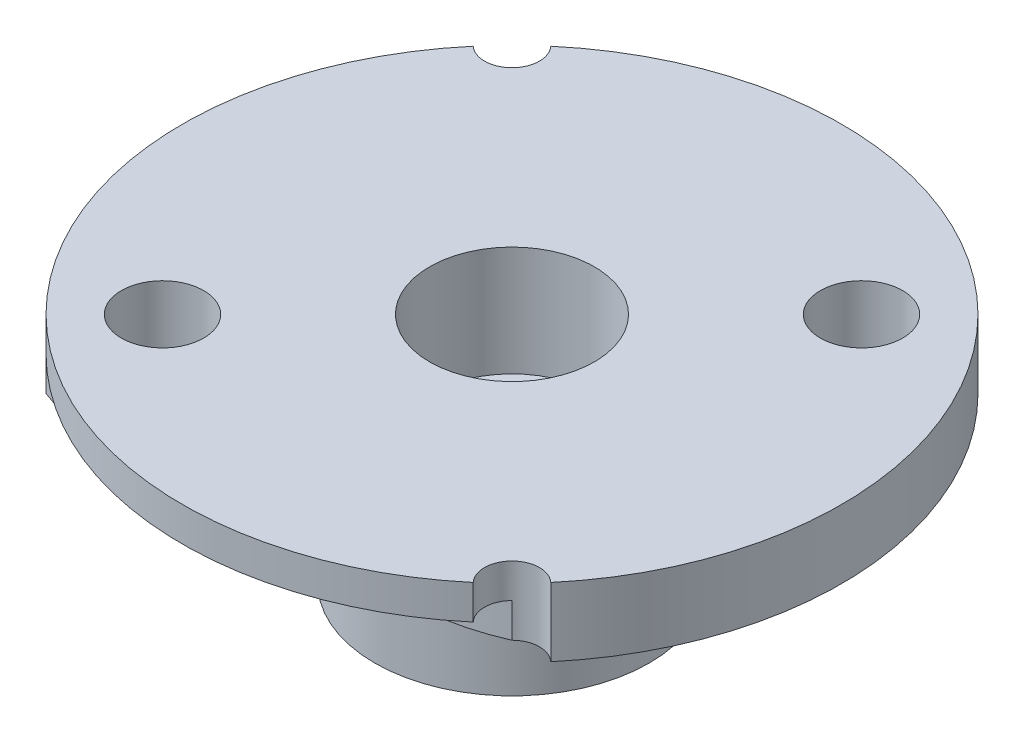
ISO-10303-21;
HEADER;
FILE_DESCRIPTION(('STEP AP214'),'2;1');
FILE_NAME('part.step','',(''),(''),'','','');
FILE_SCHEMA(('AUTOMOTIVE_DESIGN { 1 0 10303 214 1 1 1 1 }'));
ENDSEC;
DATA;
#1=APPLICATION_CONTEXT('core data for automotive mechanical design processes');
#2=APPLICATION_PROTOCOL_DEFINITION('international standard','automotive_design',2000,#1);
#3=PRODUCT_CONTEXT('',#1,'mechanical');
#4=PRODUCT('Part','Part','',(#3));
#5=PRODUCT_RELATED_PRODUCT_CATEGORY('part','',(#4));
#6=PRODUCT_DEFINITION_FORMATION('','',#4);
#7=PRODUCT_DEFINITION_CONTEXT('part definition',#1,'design');
#8=PRODUCT_DEFINITION('design','',#6,#7);
#9=PRODUCT_DEFINITION_SHAPE('','',#8);
#10=(LENGTH_UNIT() NAMED_UNIT(*) SI_UNIT(.MILLI.,.METRE.));
#11=(NAMED_UNIT(*) PLANE_ANGLE_UNIT() SI_UNIT($,.RADIAN.));
#12=(NAMED_UNIT(*) SI_UNIT($,.STERADIAN.) SOLID_ANGLE_UNIT());
#13=UNCERTAINTY_MEASURE_WITH_UNIT(LENGTH_MEASURE(1.E-05),#10,'distance_accuracy_value','');
#14=(GEOMETRIC_REPRESENTATION_CONTEXT(3) GLOBAL_UNCERTAINTY_ASSIGNED_CONTEXT((#13)) GLOBAL_UNIT_ASSIGNED_CONTEXT((#10,
#11,#12)) REPRESENTATION_CONTEXT('',''));
#15=CARTESIAN_POINT('',(0.,0.,0.));
#16=DIRECTION('',(0.,0.,1.));
#17=DIRECTION('',(1.,0.,0.));
#18=AXIS2_PLACEMENT_3D('',#15,#16,#17);
#19=CARTESIAN_POINT('',(0.,0.,0.));
#20=DIRECTION('',(0.,1.,0.));
#21=DIRECTION('',(0.,0.,1.));
#22=AXIS2_PLACEMENT_3D('',#19,#20,#21);
#23=PLANE('',#22);
#24=CARTESIAN_POINT('',(-6.36396103067893,0.,6.36396103067893));
#25=DIRECTION('',(0.,1.,0.));
#26=DIRECTION('',(0.,0.,1.));
#27=AXIS2_PLACEMENT_3D('',#24,#25,#26);
#28=CIRCLE('',#27,1.5);
#29=CARTESIAN_POINT('',(-6.36396103067893,0.,7.86396103067893));
#30=VERTEX_POINT('',#29);
#31=EDGE_CURVE('E217',#30,#30,#28,.T.);
#32=ORIENTED_EDGE('',*,*,#31,.T.);
#33=EDGE_LOOP('',(#32));
#34=FACE_BOUND('',#33,.T.);
#35=CARTESIAN_POINT('',(6.36396103067893,0.,-6.36396103067893));
#36=DIRECTION('',(0.,1.,0.));
#37=DIRECTION('',(0.,0.,1.));
#38=AXIS2_PLACEMENT_3D('',#35,#36,#37);
#39=CIRCLE('',#38,1.5);
#40=CARTESIAN_POINT('',(6.36396103067893,0.,-4.86396103067893));
#41=VERTEX_POINT('',#40);
#42=EDGE_CURVE('E221',#41,#41,#39,.T.);
#43=ORIENTED_EDGE('',*,*,#42,.T.);
#44=EDGE_LOOP('',(#43));
#45=FACE_BOUND('',#44,.T.);
#46=CARTESIAN_POINT('',(0.,0.,0.));
#47=DIRECTION('',(0.,1.,0.));
#48=DIRECTION('',(0.,0.,1.));
#49=AXIS2_PLACEMENT_3D('',#46,#47,#48);
#50=CIRCLE('',#49,5.);
#51=CARTESIAN_POINT('',(0.,0.,5.));
#52=VERTEX_POINT('',#51);
#53=EDGE_CURVE('E41',#52,#52,#50,.F.);
#54=ORIENTED_EDGE('',*,*,#53,.F.);
#55=EDGE_LOOP('',(#54));
#56=FACE_BOUND('',#55,.T.);
#57=CARTESIAN_POINT('',(-7.77817459305202,0.,-7.77817459305202));
#58=CARTESIAN_POINT('',(-4.16877268479182,0.,-9.27346294377534));
#59=CARTESIAN_POINT('',(0.223344672586166,0.,-9.41162611133245));
#60=CARTESIAN_POINT('',(3.54863571086867,0.,-6.91791439524435));
#61=B_SPLINE_CURVE_WITH_KNOTS('',3,(#57,#58,#59,#60),.UNSPECIFIED.,.F.,.F.,(4,4),(0.,1.),.UNSPECIFIED.);
#62=CARTESIAN_POINT('',(-7.77817459305201,0.,-7.77817459305204));
#63=VERTEX_POINT('',#62);
#64=CARTESIAN_POINT('',(3.54863571086867,0.,-6.91791439524435));
#65=VERTEX_POINT('',#64);
#66=EDGE_CURVE('E125',#63,#65,#61,.T.);
#67=ORIENTED_EDGE('',*,*,#66,.T.);
#68=CARTESIAN_POINT('',(8.48528137423856,0.,-8.48528137423854));
#69=CARTESIAN_POINT('',(7.76130019521036,0.,-8.81822073094651));
#70=CARTESIAN_POINT('',(6.44831782383578,0.,-9.09127511897086));
#71=CARTESIAN_POINT('',(4.85103342913824,0.,-8.31231130988514));
#72=CARTESIAN_POINT('',(4.1155277920661,0.,-7.42584743745653));
#73=CARTESIAN_POINT('',(3.96648711898213,0.,-6.47871033104911));
#74=CARTESIAN_POINT('',(3.54863571086867,0.,-6.91791439524435));
#75=B_SPLINE_CURVE_WITH_KNOTS('',3,(#68,#69,#70,#71,#72,#73,#74),.UNSPECIFIED.,.F.,.F.,(4,1,1,1,
4),(0.,0.407620337337382,0.62291443707636,0.853292729478685,1.),.UNSPECIFIED.);
#76=CARTESIAN_POINT('',(8.48528137423859,0.,-8.48528137423855));
#77=VERTEX_POINT('',#76);
#78=EDGE_CURVE('E227',#77,#65,#75,.T.);
#79=ORIENTED_EDGE('',*,*,#78,.F.);
#80=CARTESIAN_POINT('',(0.,0.,0.));
#81=DIRECTION('',(0.,1.,0.));
#82=DIRECTION('',(0.,0.,1.));
#83=AXIS2_PLACEMENT_3D('',#80,#81,#82);
#84=CIRCLE('',#83,12.);
#85=CARTESIAN_POINT('',(9.16231129826467,0.,7.7493258851136));
#86=VERTEX_POINT('',#85);
#87=EDGE_CURVE('E131',#86,#77,#84,.T.);
#88=ORIENTED_EDGE('',*,*,#87,.F.);
#89=CARTESIAN_POINT('',(8.48528137423856,0.,8.48528137423859));
#90=DIRECTION('',(0.,1.,0.));
#91=DIRECTION('',(0.,0.,1.));
#92=AXIS2_PLACEMENT_3D('',#89,#90,#91);
#93=CIRCLE('',#92,0.999999999999999);
#94=CARTESIAN_POINT('',(7.77817459305201,0.,7.77817459305204));
#95=VERTEX_POINT('',#94);
#96=EDGE_CURVE('E11',#86,#95,#93,.T.);
#97=ORIENTED_EDGE('',*,*,#96,.T.);
#98=CARTESIAN_POINT('',(7.77817459305199,0.,7.77817459305204));
#99=CARTESIAN_POINT('',(6.04376247071958,0.,8.55328477138412));
#100=CARTESIAN_POINT('',(1.93848679017031,0.,8.68342580428797));
#101=CARTESIAN_POINT('',(-2.11467577036913,0.,7.90596731774284));
#102=CARTESIAN_POINT('',(-3.96707467213729,0.,6.47855976662573));
#103=B_SPLINE_CURVE_WITH_KNOTS('',3,(#98,#99,#100,#101,#102),.UNSPECIFIED.,.F.,.F.,(4,1,4),(0.,
0.452400817046279,1.),.UNSPECIFIED.);
#104=CARTESIAN_POINT('',(-3.96707467213729,0.,6.47855976662573));
#105=VERTEX_POINT('',#104);
#106=EDGE_CURVE('E142',#95,#105,#103,.T.);
#107=ORIENTED_EDGE('',*,*,#106,.T.);
#108=CARTESIAN_POINT('',(-8.48528137423859,0.,8.48528137423855));
#109=CARTESIAN_POINT('',(-7.59274033381994,0.,8.84512034352822));
#110=CARTESIAN_POINT('',(-6.31385241120329,0.,9.008442263453));
#111=CARTESIAN_POINT('',(-4.85899912603953,0.,8.38704786459772));
#112=CARTESIAN_POINT('',(-4.26431301803857,0.,7.60850715839716));
#113=CARTESIAN_POINT('',(-4.07283738267023,0.,6.86756436959181));
#114=CARTESIAN_POINT('',(-4.14747656068996,0.,6.38734892089447));
#115=CARTESIAN_POINT('',(-3.96707467213729,0.,6.47855976662573));
#116=B_SPLINE_CURVE_WITH_KNOTS('',3,(#108,#109,#110,#111,#112,#113,#114,#115),.UNSPECIFIED.,.F.,
.F.,(4,1,1,1,1,4),(0.,0.492098519229131,0.601947317345976,0.788100157359678,0.955757020767427,
1.),.UNSPECIFIED.);
#117=CARTESIAN_POINT('',(-8.48528137423859,0.,8.48528137423855));
#118=VERTEX_POINT('',#117);
#119=EDGE_CURVE('E241',#118,#105,#116,.T.);
#120=ORIENTED_EDGE('',*,*,#119,.F.);
#121=CARTESIAN_POINT('',(-9.16231129826467,0.,-7.7493258851136));
#122=VERTEX_POINT('',#121);
#123=EDGE_CURVE('E308',#122,#118,#84,.T.);
#124=ORIENTED_EDGE('',*,*,#123,.F.);
#125=CARTESIAN_POINT('',(-8.48528137423856,0.,-8.48528137423859));
#126=DIRECTION('',(0.,-1.,0.));
#127=DIRECTION('',(0.,0.,-1.));
#128=AXIS2_PLACEMENT_3D('',#125,#126,#127);
#129=CIRCLE('',#128,1.);
#130=EDGE_CURVE('E229',#63,#122,#129,.T.);
#131=ORIENTED_EDGE('',*,*,#130,.F.);
#132=EDGE_LOOP('',(#67,#79,#88,#97,#107,#120,#124,#131));
#133=FACE_BOUND('',#132,.T.);
#134=ADVANCED_FACE('F33',(#34,#45,#56,#133),#23,.F.);
#135=CARTESIAN_POINT('',(-8.48528137423856,4.,-8.48528137423859));
#136=DIRECTION('',(0.,-1.,0.));
#137=DIRECTION('',(0.,0.,-1.));
#138=AXIS2_PLACEMENT_3D('',#135,#136,#137);
#139=CYLINDRICAL_SURFACE('',#138,1.);
#140=DIRECTION('',(0.,-1.,0.));
#141=VECTOR('',#140,1.);
#142=CARTESIAN_POINT('',(-7.77817459305201,1.25,-7.77817459305204));
#143=LINE('',#142,#141);
#144=CARTESIAN_POINT('',(-7.77817459305201,1.25,-7.77817459305204));
#145=VERTEX_POINT('',#144);
#146=EDGE_CURVE('E133',#145,#63,#143,.T.);
#147=ORIENTED_EDGE('',*,*,#146,.T.);
#148=ORIENTED_EDGE('',*,*,#130,.T.);
#149=DIRECTION('',(0.,-1.,0.));
#150=VECTOR('',#149,1.);
#151=CARTESIAN_POINT('',(-9.16231129826467,2.,-7.7493258851136));
#152=LINE('',#151,#150);
#153=CARTESIAN_POINT('',(-9.16231129826468,2.5,-7.74932588511359));
#154=VERTEX_POINT('',#153);
#155=EDGE_CURVE('E271',#154,#122,#152,.T.);
#156=ORIENTED_EDGE('',*,*,#155,.F.);
#157=CARTESIAN_POINT('',(-8.48528137423856,2.5,-8.48528137423859));
#158=DIRECTION('',(0.,1.,0.));
#159=DIRECTION('',(0.,0.,1.));
#160=AXIS2_PLACEMENT_3D('',#157,#158,#159);
#161=CIRCLE('',#160,1.);
#162=CARTESIAN_POINT('',(-7.74932588511355,2.5,-9.16231129826471));
#163=VERTEX_POINT('',#162);
#164=EDGE_CURVE('E268',#154,#163,#161,.T.);
#165=ORIENTED_EDGE('',*,*,#164,.T.);
#166=DIRECTION('',(0.,-1.,0.));
#167=VECTOR('',#166,1.);
#168=CARTESIAN_POINT('',(-7.74932588511357,2.,-9.16231129826469));
#169=LINE('',#168,#167);
#170=CARTESIAN_POINT('',(-7.74932588511355,1.25,-9.16231129826471));
#171=VERTEX_POINT('',#170);
#172=EDGE_CURVE('E274',#171,#163,#169,.F.);
#173=ORIENTED_EDGE('',*,*,#172,.F.);
#174=CARTESIAN_POINT('',(-8.48528137423856,1.25,-8.48528137423859));
#175=DIRECTION('',(0.,-1.,0.));
#176=DIRECTION('',(0.,0.,-1.));
#177=AXIS2_PLACEMENT_3D('',#174,#175,#176);
#178=CIRCLE('',#177,1.);
#179=EDGE_CURVE('E122',#145,#171,#178,.F.);
#180=ORIENTED_EDGE('',*,*,#179,.F.);
#181=EDGE_LOOP('',(#147,#148,#156,#165,#173,#180));
#182=FACE_BOUND('',#181,.T.);
#183=ADVANCED_FACE('F163',(#182),#139,.F.);
#184=CARTESIAN_POINT('',(8.48528137423856,4.,8.48528137423859));
#185=DIRECTION('',(0.,-1.,0.));
#186=DIRECTION('',(0.,0.,-1.));
#187=AXIS2_PLACEMENT_3D('',#184,#185,#186);
#188=CYLINDRICAL_SURFACE('',#187,0.999999999999999);
#189=DIRECTION('',(0.,-1.,0.));
#190=VECTOR('',#189,1.);
#191=CARTESIAN_POINT('',(7.77817459305201,1.25,7.77817459305204));
#192=LINE('',#191,#190);
#193=CARTESIAN_POINT('',(7.77817459305201,1.25,7.77817459305204));
#194=VERTEX_POINT('',#193);
#195=EDGE_CURVE('E257',#194,#95,#192,.T.);
#196=ORIENTED_EDGE('',*,*,#195,.T.);
#197=ORIENTED_EDGE('',*,*,#96,.F.);
#198=DIRECTION('',(0.,-1.,0.));
#199=VECTOR('',#198,1.);
#200=CARTESIAN_POINT('',(9.16231129826467,2.,7.7493258851136));
#201=LINE('',#200,#199);
#202=CARTESIAN_POINT('',(9.16231129826468,2.5,7.74932588511359));
#203=VERTEX_POINT('',#202);
#204=EDGE_CURVE('E279',#203,#86,#201,.T.);
#205=ORIENTED_EDGE('',*,*,#204,.F.);
#206=CARTESIAN_POINT('',(8.48528137423856,2.5,8.48528137423859));
#207=DIRECTION('',(0.,1.,0.));
#208=DIRECTION('',(0.,0.,1.));
#209=AXIS2_PLACEMENT_3D('',#206,#207,#208);
#210=CIRCLE('',#209,0.999999999999999);
#211=CARTESIAN_POINT('',(7.74932588511355,2.5,9.16231129826471));
#212=VERTEX_POINT('',#211);
#213=EDGE_CURVE('E276',#203,#212,#210,.T.);
#214=ORIENTED_EDGE('',*,*,#213,.T.);
#215=DIRECTION('',(0.,-1.,0.));
#216=VECTOR('',#215,1.);
#217=CARTESIAN_POINT('',(7.74932588511357,2.,9.16231129826469));
#218=LINE('',#217,#216);
#219=CARTESIAN_POINT('',(7.74932588511357,1.25,9.16231129826469));
#220=VERTEX_POINT('',#219);
#221=EDGE_CURVE('E281',#220,#212,#218,.F.);
#222=ORIENTED_EDGE('',*,*,#221,.F.);
#223=CARTESIAN_POINT('',(8.48528137423856,1.25,8.48528137423859));
#224=DIRECTION('',(0.,-1.,0.));
#225=DIRECTION('',(0.,0.,-1.));
#226=AXIS2_PLACEMENT_3D('',#223,#224,#225);
#227=CIRCLE('',#226,0.999999999999999);
#228=EDGE_CURVE('E250',#194,#220,#227,.F.);
#229=ORIENTED_EDGE('',*,*,#228,.F.);
#230=EDGE_LOOP('',(#196,#197,#205,#214,#222,#229));
#231=FACE_BOUND('',#230,.T.);
#232=ADVANCED_FACE('F166',(#231),#188,.F.);
#233=CARTESIAN_POINT('',(0.,2.5,0.));
#234=DIRECTION('',(0.,-1.,0.));
#235=DIRECTION('',(0.,0.,-1.));
#236=AXIS2_PLACEMENT_3D('',#233,#234,#235);
#237=CYLINDRICAL_SURFACE('',#236,12.);
#238=ORIENTED_EDGE('',*,*,#87,.T.);
#239=DIRECTION('',(0.,-1.,0.));
#240=VECTOR('',#239,1.);
#241=CARTESIAN_POINT('',(8.48528137423859,1.25,-8.48528137423855));
#242=LINE('',#241,#240);
#243=CARTESIAN_POINT('',(8.48528137423859,1.25,-8.48528137423855));
#244=VERTEX_POINT('',#243);
#245=EDGE_CURVE('E114',#244,#77,#242,.T.);
#246=ORIENTED_EDGE('',*,*,#245,.F.);
#247=CARTESIAN_POINT('',(0.,1.25,0.));
#248=DIRECTION('',(0.,-1.,0.));
#249=DIRECTION('',(0.,0.,-1.));
#250=AXIS2_PLACEMENT_3D('',#247,#248,#249);
#251=CIRCLE('',#250,12.);
#252=EDGE_CURVE('E117',#171,#244,#251,.T.);
#253=ORIENTED_EDGE('',*,*,#252,.F.);
#254=ORIENTED_EDGE('',*,*,#172,.T.);
#255=CARTESIAN_POINT('',(0.,2.5,0.));
#256=DIRECTION('',(0.,1.,0.));
#257=DIRECTION('',(0.,0.,1.));
#258=AXIS2_PLACEMENT_3D('',#255,#256,#257);
#259=CIRCLE('',#258,12.);
#260=EDGE_CURVE('E309',#203,#163,#259,.T.);
#261=ORIENTED_EDGE('',*,*,#260,.F.);
#262=ORIENTED_EDGE('',*,*,#204,.T.);
#263=EDGE_LOOP('',(#238,#246,#253,#254,#261,#262));
#264=FACE_BOUND('',#263,.T.);
#265=ADVANCED_FACE('F128',(#264),#237,.T.);
#266=CARTESIAN_POINT('',(0.,-9.5,0.));
#267=DIRECTION('',(0.,1.,0.));
#268=DIRECTION('',(0.,0.,1.));
#269=AXIS2_PLACEMENT_3D('',#266,#267,#268);
#270=CYLINDRICAL_SURFACE('',#269,1.5);
#271=CARTESIAN_POINT('',(0.,-1.5,0.));
#272=DIRECTION('',(0.,1.,0.));
#273=DIRECTION('',(0.,0.,1.));
#274=AXIS2_PLACEMENT_3D('',#271,#272,#273);
#275=CIRCLE('',#274,1.5);
#276=CARTESIAN_POINT('',(0.,-1.5,1.5));
#277=VERTEX_POINT('',#276);
#278=EDGE_CURVE('E296',#277,#277,#275,.T.);
#279=ORIENTED_EDGE('',*,*,#278,.T.);
#280=EDGE_LOOP('',(#279));
#281=FACE_BOUND('',#280,.T.);
#282=CARTESIAN_POINT('',(0.,-2.,0.));
#283=DIRECTION('',(0.,-1.,0.));
#284=DIRECTION('',(0.,0.,-1.));
#285=AXIS2_PLACEMENT_3D('',#282,#283,#284);
#286=CIRCLE('',#285,1.5);
#287=CARTESIAN_POINT('',(0.,-2.,-1.5));
#288=VERTEX_POINT('',#287);
#289=EDGE_CURVE('E292',#288,#288,#286,.F.);
#290=ORIENTED_EDGE('',*,*,#289,.F.);
#291=EDGE_LOOP('',(#290));
#292=FACE_BOUND('',#291,.T.);
#293=ADVANCED_FACE('F188',(#281,#292),#270,.F.);
#294=ORIENTED_EDGE('',*,*,#123,.T.);
#295=DIRECTION('',(0.,-1.,0.));
#296=VECTOR('',#295,1.);
#297=CARTESIAN_POINT('',(-8.48528137423859,1.25,8.48528137423855));
#298=LINE('',#297,#296);
#299=CARTESIAN_POINT('',(-8.48528137423859,1.25,8.48528137423855));
#300=VERTEX_POINT('',#299);
#301=EDGE_CURVE('E265',#300,#118,#298,.T.);
#302=ORIENTED_EDGE('',*,*,#301,.F.);
#303=CARTESIAN_POINT('',(0.,1.25,0.));
#304=DIRECTION('',(0.,-1.,0.));
#305=DIRECTION('',(0.,0.,-1.));
#306=AXIS2_PLACEMENT_3D('',#303,#304,#305);
#307=CIRCLE('',#306,12.);
#308=EDGE_CURVE('E138',#220,#300,#307,.T.);
#309=ORIENTED_EDGE('',*,*,#308,.F.);
#310=ORIENTED_EDGE('',*,*,#221,.T.);
#311=EDGE_CURVE('E312',#154,#212,#259,.T.);
#312=ORIENTED_EDGE('',*,*,#311,.F.);
#313=ORIENTED_EDGE('',*,*,#155,.T.);
#314=EDGE_LOOP('',(#294,#302,#309,#310,#312,#313));
#315=FACE_BOUND('',#314,.T.);
#316=ADVANCED_FACE('F35',(#315),#237,.T.);
#317=CARTESIAN_POINT('',(0.,2.5,0.));
#318=DIRECTION('',(0.,1.,0.));
#319=DIRECTION('',(0.,0.,1.));
#320=AXIS2_PLACEMENT_3D('',#317,#318,#319);
#321=PLANE('',#320);
#322=ORIENTED_EDGE('',*,*,#164,.F.);
#323=ORIENTED_EDGE('',*,*,#311,.T.);
#324=ORIENTED_EDGE('',*,*,#213,.F.);
#325=ORIENTED_EDGE('',*,*,#260,.T.);
#326=EDGE_LOOP('',(#322,#323,#324,#325));
#327=FACE_BOUND('',#326,.T.);
#328=CARTESIAN_POINT('',(-6.36396103067893,2.5,6.36396103067893));
#329=DIRECTION('',(0.,1.,0.));
#330=DIRECTION('',(0.,0.,1.));
#331=AXIS2_PLACEMENT_3D('',#328,#329,#330);
#332=CIRCLE('',#331,1.5);
#333=CARTESIAN_POINT('',(-6.36396103067893,2.5,7.86396103067893));
#334=VERTEX_POINT('',#333);
#335=EDGE_CURVE('E283',#334,#334,#332,.T.);
#336=ORIENTED_EDGE('',*,*,#335,.F.);
#337=EDGE_LOOP('',(#336));
#338=FACE_BOUND('',#337,.T.);
#339=CARTESIAN_POINT('',(6.36396103067893,2.5,-6.36396103067893));
#340=DIRECTION('',(0.,1.,0.));
#341=DIRECTION('',(0.,0.,1.));
#342=AXIS2_PLACEMENT_3D('',#339,#340,#341);
#343=CIRCLE('',#342,1.5);
#344=CARTESIAN_POINT('',(6.36396103067893,2.5,-4.86396103067893));
#345=VERTEX_POINT('',#344);
#346=EDGE_CURVE('E286',#345,#345,#343,.T.);
#347=ORIENTED_EDGE('',*,*,#346,.F.);
#348=EDGE_LOOP('',(#347));
#349=FACE_BOUND('',#348,.T.);
#350=CARTESIAN_POINT('',(0.,2.5,0.));
#351=DIRECTION('',(0.,1.,0.));
#352=DIRECTION('',(0.,0.,1.));
#353=AXIS2_PLACEMENT_3D('',#350,#351,#352);
#354=CIRCLE('',#353,3.00145356449365);
#355=CARTESIAN_POINT('',(0.,2.5,3.00145356449365));
#356=VERTEX_POINT('',#355);
#357=EDGE_CURVE('E299',#356,#356,#354,.T.);
#358=ORIENTED_EDGE('',*,*,#357,.F.);
#359=EDGE_LOOP('',(#358));
#360=FACE_BOUND('',#359,.T.);
#361=ADVANCED_FACE('F206',(#327,#338,#349,#360),#321,.T.);
#362=CARTESIAN_POINT('',(0.,-6.,0.));
#363=DIRECTION('',(0.,1.,0.));
#364=DIRECTION('',(0.,0.,1.));
#365=AXIS2_PLACEMENT_3D('',#362,#363,#364);
#366=CYLINDRICAL_SURFACE('',#365,5.);
#367=CARTESIAN_POINT('',(0.,-6.,0.));
#368=DIRECTION('',(0.,-1.,0.));
#369=DIRECTION('',(0.,0.,-1.));
#370=AXIS2_PLACEMENT_3D('',#367,#368,#369);
#371=CIRCLE('',#370,5.);
#372=CARTESIAN_POINT('',(0.,-6.,-5.));
#373=VERTEX_POINT('',#372);
#374=EDGE_CURVE('E303',#373,#373,#371,.T.);
#375=ORIENTED_EDGE('',*,*,#374,.F.);
#376=EDGE_LOOP('',(#375));
#377=FACE_BOUND('',#376,.T.);
#378=ORIENTED_EDGE('',*,*,#53,.T.);
#379=EDGE_LOOP('',(#378));
#380=FACE_BOUND('',#379,.T.);
#381=ADVANCED_FACE('F202',(#377,#380),#366,.T.);
#382=CARTESIAN_POINT('',(0.,-6.,0.));
#383=DIRECTION('',(0.,-1.,0.));
#384=DIRECTION('',(0.,0.,-1.));
#385=AXIS2_PLACEMENT_3D('',#382,#383,#384);
#386=PLANE('',#385);
#387=CARTESIAN_POINT('',(0.,-6.,0.));
#388=DIRECTION('',(0.,-1.,0.));
#389=DIRECTION('',(0.,0.,-1.));
#390=AXIS2_PLACEMENT_3D('',#387,#388,#389);
#391=CIRCLE('',#390,2.);
#392=CARTESIAN_POINT('',(0.,-6.,-2.));
#393=VERTEX_POINT('',#392);
#394=EDGE_CURVE('E293',#393,#393,#391,.T.);
#395=ORIENTED_EDGE('',*,*,#394,.F.);
#396=EDGE_LOOP('',(#395));
#397=FACE_BOUND('',#396,.T.);
#398=ORIENTED_EDGE('',*,*,#374,.T.);
#399=EDGE_LOOP('',(#398));
#400=FACE_BOUND('',#399,.T.);
#401=ADVANCED_FACE('F198',(#397,#400),#386,.T.);
#402=CARTESIAN_POINT('',(0.,-1.5,0.));
#403=DIRECTION('',(0.,1.,0.));
#404=DIRECTION('',(0.,0.,1.));
#405=AXIS2_PLACEMENT_3D('',#402,#403,#404);
#406=CYLINDRICAL_SURFACE('',#405,3.00145356449365);
#407=CARTESIAN_POINT('',(0.,-1.5,0.));
#408=DIRECTION('',(0.,1.,0.));
#409=DIRECTION('',(0.,0.,1.));
#410=AXIS2_PLACEMENT_3D('',#407,#408,#409);
#411=CIRCLE('',#410,3.00145356449365);
#412=CARTESIAN_POINT('',(0.,-1.5,3.00145356449365));
#413=VERTEX_POINT('',#412);
#414=EDGE_CURVE('E300',#413,#413,#411,.T.);
#415=ORIENTED_EDGE('',*,*,#414,.F.);
#416=EDGE_LOOP('',(#415));
#417=FACE_BOUND('',#416,.T.);
#418=ORIENTED_EDGE('',*,*,#357,.T.);
#419=EDGE_LOOP('',(#418));
#420=FACE_BOUND('',#419,.T.);
#421=ADVANCED_FACE('F194',(#417,#420),#406,.F.);
#422=CARTESIAN_POINT('',(0.,-1.5,0.));
#423=DIRECTION('',(0.,1.,0.));
#424=DIRECTION('',(0.,0.,1.));
#425=AXIS2_PLACEMENT_3D('',#422,#423,#424);
#426=PLANE('',#425);
#427=ORIENTED_EDGE('',*,*,#278,.F.);
#428=EDGE_LOOP('',(#427));
#429=FACE_BOUND('',#428,.T.);
#430=ORIENTED_EDGE('',*,*,#414,.T.);
#431=EDGE_LOOP('',(#430));
#432=FACE_BOUND('',#431,.T.);
#433=ADVANCED_FACE('F183',(#429,#432),#426,.T.);
#434=CARTESIAN_POINT('',(0.,-2.,0.));
#435=DIRECTION('',(0.,-1.,0.));
#436=DIRECTION('',(0.,0.,-1.));
#437=AXIS2_PLACEMENT_3D('',#434,#435,#436);
#438=PLANE('',#437);
#439=CARTESIAN_POINT('',(0.,-2.,0.));
#440=DIRECTION('',(0.,-1.,0.));
#441=DIRECTION('',(0.,0.,-1.));
#442=AXIS2_PLACEMENT_3D('',#439,#440,#441);
#443=CIRCLE('',#442,2.);
#444=CARTESIAN_POINT('',(0.,-2.,-2.));
#445=VERTEX_POINT('',#444);
#446=EDGE_CURVE('E289',#445,#445,#443,.T.);
#447=ORIENTED_EDGE('',*,*,#446,.T.);
#448=EDGE_LOOP('',(#447));
#449=FACE_BOUND('',#448,.T.);
#450=ORIENTED_EDGE('',*,*,#289,.T.);
#451=EDGE_LOOP('',(#450));
#452=FACE_BOUND('',#451,.T.);
#453=ADVANCED_FACE('F180',(#449,#452),#438,.T.);
#454=CARTESIAN_POINT('',(0.,-2.,0.));
#455=DIRECTION('',(0.,-1.,0.));
#456=DIRECTION('',(0.,0.,-1.));
#457=AXIS2_PLACEMENT_3D('',#454,#455,#456);
#458=CYLINDRICAL_SURFACE('',#457,2.);
#459=ORIENTED_EDGE('',*,*,#446,.F.);
#460=EDGE_LOOP('',(#459));
#461=FACE_BOUND('',#460,.T.);
#462=ORIENTED_EDGE('',*,*,#394,.T.);
#463=EDGE_LOOP('',(#462));
#464=FACE_BOUND('',#463,.T.);
#465=ADVANCED_FACE('F178',(#461,#464),#458,.F.);
#466=CARTESIAN_POINT('',(6.36396103067893,-1.5,-6.36396103067893));
#467=DIRECTION('',(0.,1.,0.));
#468=DIRECTION('',(0.,0.,1.));
#469=AXIS2_PLACEMENT_3D('',#466,#467,#468);
#470=CYLINDRICAL_SURFACE('',#469,1.5);
#471=ORIENTED_EDGE('',*,*,#346,.T.);
#472=EDGE_LOOP('',(#471));
#473=FACE_BOUND('',#472,.T.);
#474=ORIENTED_EDGE('',*,*,#42,.F.);
#475=EDGE_LOOP('',(#474));
#476=FACE_BOUND('',#475,.T.);
#477=ADVANCED_FACE('F174',(#473,#476),#470,.F.);
#478=CARTESIAN_POINT('',(-6.36396103067893,-1.5,6.36396103067893));
#479=DIRECTION('',(0.,1.,0.));
#480=DIRECTION('',(0.,0.,1.));
#481=AXIS2_PLACEMENT_3D('',#478,#479,#480);
#482=CYLINDRICAL_SURFACE('',#481,1.5);
#483=ORIENTED_EDGE('',*,*,#335,.T.);
#484=EDGE_LOOP('',(#483));
#485=FACE_BOUND('',#484,.T.);
#486=ORIENTED_EDGE('',*,*,#31,.F.);
#487=EDGE_LOOP('',(#486));
#488=FACE_BOUND('',#487,.T.);
#489=ADVANCED_FACE('F171',(#485,#488),#482,.F.);
#490=CARTESIAN_POINT('',(7.77817459305199,1.25,7.77817459305204));
#491=CARTESIAN_POINT('',(6.04376247071958,1.25,8.55328477138412));
#492=CARTESIAN_POINT('',(1.93848679017031,1.25,8.68342580428797));
#493=CARTESIAN_POINT('',(-2.11467577036913,1.25,7.90596731774284));
#494=CARTESIAN_POINT('',(-3.96707467213729,1.25,6.47855976662573));
#495=B_SPLINE_CURVE_WITH_KNOTS('',3,(#490,#491,#492,#493,#494),.UNSPECIFIED.,.F.,.F.,(4,1,4),
(0.,0.452400817046279,1.),.UNSPECIFIED.);
#496=DIRECTION('',(0.,-1.,0.));
#497=VECTOR('',#496,1.);
#498=SURFACE_OF_LINEAR_EXTRUSION('',#495,#497);
#499=ORIENTED_EDGE('',*,*,#106,.F.);
#500=ORIENTED_EDGE('',*,*,#195,.F.);
#501=CARTESIAN_POINT('',(-3.96707467213729,1.25,6.47855976662573));
#502=VERTEX_POINT('',#501);
#503=EDGE_CURVE('E56',#194,#502,#495,.T.);
#504=ORIENTED_EDGE('',*,*,#503,.T.);
#505=DIRECTION('',(0.,-1.,0.));
#506=VECTOR('',#505,1.);
#507=CARTESIAN_POINT('',(-3.96707467213729,1.25,6.47855976662573));
#508=LINE('',#507,#506);
#509=EDGE_CURVE('E263',#502,#105,#508,.T.);
#510=ORIENTED_EDGE('',*,*,#509,.T.);
#511=EDGE_LOOP('',(#499,#500,#504,#510));
#512=FACE_BOUND('',#511,.T.);
#513=ADVANCED_FACE('F160',(#512),#498,.T.);
#514=CARTESIAN_POINT('',(-8.48528137423859,1.25,8.48528137423855));
#515=CARTESIAN_POINT('',(-7.59274033381994,1.25,8.84512034352822));
#516=CARTESIAN_POINT('',(-6.31385241120329,1.25,9.008442263453));
#517=CARTESIAN_POINT('',(-4.85899912603953,1.25,8.38704786459772));
#518=CARTESIAN_POINT('',(-4.26431301803857,1.25,7.60850715839716));
#519=CARTESIAN_POINT('',(-4.07283738267023,1.25,6.86756436959181));
#520=CARTESIAN_POINT('',(-4.14747656068996,1.25,6.38734892089447));
#521=CARTESIAN_POINT('',(-3.96707467213729,1.25,6.47855976662573));
#522=B_SPLINE_CURVE_WITH_KNOTS('',3,(#514,#515,#516,#517,#518,#519,#520,#521),.UNSPECIFIED.,.F.,
.F.,(4,1,1,1,1,4),(0.,0.492098519229131,0.601947317345976,0.788100157359678,0.955757020767427,
1.),.UNSPECIFIED.);
#523=DIRECTION('',(0.,-1.,0.));
#524=VECTOR('',#523,1.);
#525=SURFACE_OF_LINEAR_EXTRUSION('',#522,#524);
#526=ORIENTED_EDGE('',*,*,#119,.T.);
#527=ORIENTED_EDGE('',*,*,#509,.F.);
#528=EDGE_CURVE('E141',#300,#502,#522,.T.);
#529=ORIENTED_EDGE('',*,*,#528,.F.);
#530=ORIENTED_EDGE('',*,*,#301,.T.);
#531=EDGE_LOOP('',(#526,#527,#529,#530));
#532=FACE_BOUND('',#531,.T.);
#533=ADVANCED_FACE('F155',(#532),#525,.F.);
#534=CARTESIAN_POINT('',(0.,1.25,0.));
#535=DIRECTION('',(0.,-1.,0.));
#536=DIRECTION('',(0.,0.,-1.));
#537=AXIS2_PLACEMENT_3D('',#534,#535,#536);
#538=PLANE('',#537);
#539=ORIENTED_EDGE('',*,*,#308,.T.);
#540=ORIENTED_EDGE('',*,*,#528,.T.);
#541=ORIENTED_EDGE('',*,*,#503,.F.);
#542=ORIENTED_EDGE('',*,*,#228,.T.);
#543=EDGE_LOOP('',(#539,#540,#541,#542));
#544=FACE_BOUND('',#543,.T.);
#545=ADVANCED_FACE('F159',(#544),#538,.T.);
#546=CARTESIAN_POINT('',(-7.77817459305202,1.25,-7.77817459305202));
#547=CARTESIAN_POINT('',(-4.16877268479182,1.25,-9.27346294377534));
#548=CARTESIAN_POINT('',(0.223344672586166,1.25,-9.41162611133245));
#549=CARTESIAN_POINT('',(3.54863571086867,1.25,-6.91791439524435));
#550=B_SPLINE_CURVE_WITH_KNOTS('',3,(#546,#547,#548,#549),.UNSPECIFIED.,.F.,.F.,(4,4),(0.,1.),.UNSPECIFIED.);
#551=DIRECTION('',(0.,-1.,0.));
#552=VECTOR('',#551,1.);
#553=SURFACE_OF_LINEAR_EXTRUSION('',#550,#552);
#554=ORIENTED_EDGE('',*,*,#66,.F.);
#555=ORIENTED_EDGE('',*,*,#146,.F.);
#556=CARTESIAN_POINT('',(3.54863571086867,1.25,-6.91791439524435));
#557=VERTEX_POINT('',#556);
#558=EDGE_CURVE('E48',#145,#557,#550,.T.);
#559=ORIENTED_EDGE('',*,*,#558,.T.);
#560=DIRECTION('',(0.,-1.,0.));
#561=VECTOR('',#560,1.);
#562=CARTESIAN_POINT('',(3.54863571086867,1.25,-6.91791439524435));
#563=LINE('',#562,#561);
#564=EDGE_CURVE('E116',#557,#65,#563,.T.);
#565=ORIENTED_EDGE('',*,*,#564,.T.);
#566=EDGE_LOOP('',(#554,#555,#559,#565));
#567=FACE_BOUND('',#566,.T.);
#568=ADVANCED_FACE('F343',(#567),#553,.T.);
#569=CARTESIAN_POINT('',(8.48528137423856,1.25,-8.48528137423854));
#570=CARTESIAN_POINT('',(7.76130019521036,1.25,-8.81822073094651));
#571=CARTESIAN_POINT('',(6.44831782383578,1.25,-9.09127511897086));
#572=CARTESIAN_POINT('',(4.85103342913824,1.25,-8.31231130988514));
#573=CARTESIAN_POINT('',(4.1155277920661,1.25,-7.42584743745653));
#574=CARTESIAN_POINT('',(3.96648711898213,1.25,-6.47871033104911));
#575=CARTESIAN_POINT('',(3.54863571086867,1.25,-6.91791439524435));
#576=B_SPLINE_CURVE_WITH_KNOTS('',3,(#569,#570,#571,#572,#573,#574,#575),.UNSPECIFIED.,.F.,.F.,
(4,1,1,1,4),(0.,0.407620337337382,0.62291443707636,0.853292729478685,1.),.UNSPECIFIED.);
#577=DIRECTION('',(0.,-1.,0.));
#578=VECTOR('',#577,1.);
#579=SURFACE_OF_LINEAR_EXTRUSION('',#576,#578);
#580=ORIENTED_EDGE('',*,*,#78,.T.);
#581=ORIENTED_EDGE('',*,*,#564,.F.);
#582=EDGE_CURVE('E109',#244,#557,#576,.T.);
#583=ORIENTED_EDGE('',*,*,#582,.F.);
#584=ORIENTED_EDGE('',*,*,#245,.T.);
#585=EDGE_LOOP('',(#580,#581,#583,#584));
#586=FACE_BOUND('',#585,.T.);
#587=ADVANCED_FACE('F112',(#586),#579,.F.);
#588=CARTESIAN_POINT('',(0.,1.25,0.));
#589=DIRECTION('',(0.,-1.,0.));
#590=DIRECTION('',(0.,0.,-1.));
#591=AXIS2_PLACEMENT_3D('',#588,#589,#590);
#592=PLANE('',#591);
#593=ORIENTED_EDGE('',*,*,#252,.T.);
#594=ORIENTED_EDGE('',*,*,#582,.T.);
#595=ORIENTED_EDGE('',*,*,#558,.F.);
#596=ORIENTED_EDGE('',*,*,#179,.T.);
#597=EDGE_LOOP('',(#593,#594,#595,#596));
#598=FACE_BOUND('',#597,.T.);
#599=ADVANCED_FACE('F120',(#598),#592,.T.);
#600=CLOSED_SHELL('',(#134,#183,#232,#265,#293,#316,#361,#381,#401,#421,#433,#453,#465,#477,
#489,#513,#533,#545,#568,#587,#599));
#601=MANIFOLD_SOLID_BREP('B2',#600);
#602=ADVANCED_BREP_SHAPE_REPRESENTATION('',(#18,#601),#14);
#603=SHAPE_DEFINITION_REPRESENTATION(#9,#602);
ENDSEC;
END-ISO-10303-21;
